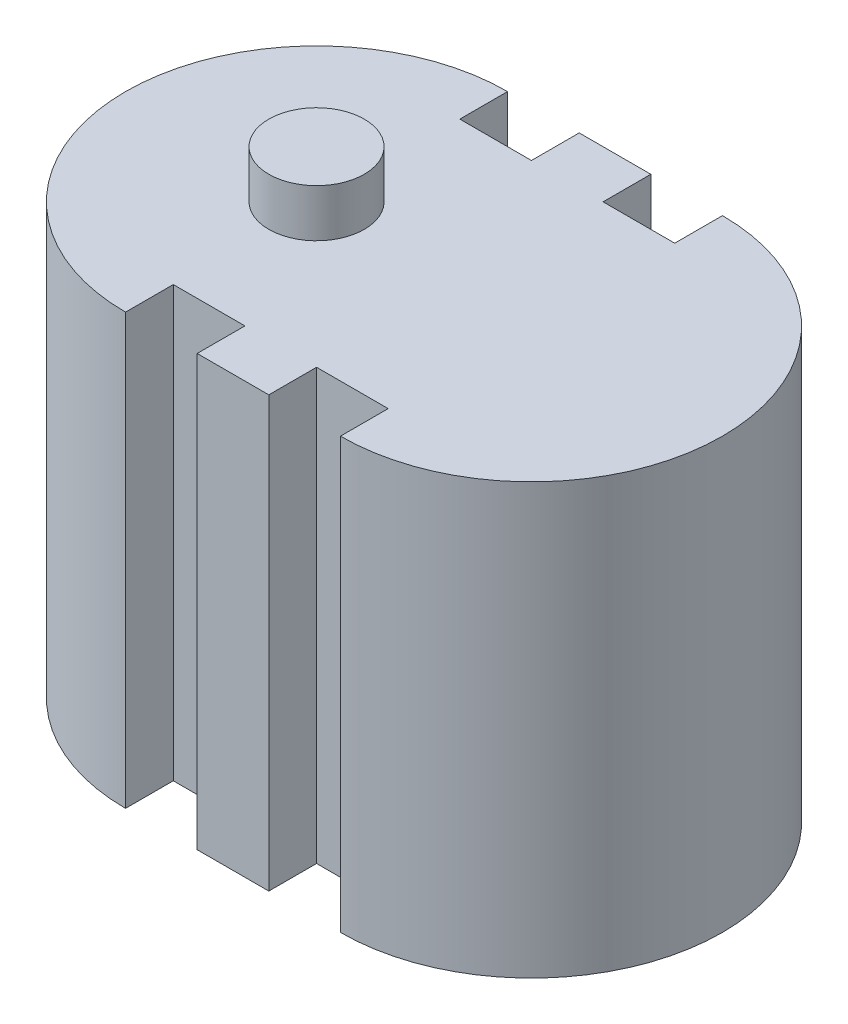
ISO-10303-21;
HEADER;
FILE_DESCRIPTION(('STEP AP214'),'2;1');
FILE_NAME('part.step','',(''),(''),'','','');
FILE_SCHEMA(('AUTOMOTIVE_DESIGN { 1 0 10303 214 1 1 1 1 }'));
ENDSEC;
DATA;
#1=APPLICATION_CONTEXT('core data for automotive mechanical design processes');
#2=APPLICATION_PROTOCOL_DEFINITION('international standard','automotive_design',2000,#1);
#3=PRODUCT_CONTEXT('',#1,'mechanical');
#4=PRODUCT('Part','Part','',(#3));
#5=PRODUCT_RELATED_PRODUCT_CATEGORY('part','',(#4));
#6=PRODUCT_DEFINITION_FORMATION('','',#4);
#7=PRODUCT_DEFINITION_CONTEXT('part definition',#1,'design');
#8=PRODUCT_DEFINITION('design','',#6,#7);
#9=PRODUCT_DEFINITION_SHAPE('','',#8);
#10=(LENGTH_UNIT() NAMED_UNIT(*) SI_UNIT(.MILLI.,.METRE.));
#11=(NAMED_UNIT(*) PLANE_ANGLE_UNIT() SI_UNIT($,.RADIAN.));
#12=(NAMED_UNIT(*) SI_UNIT($,.STERADIAN.) SOLID_ANGLE_UNIT());
#13=UNCERTAINTY_MEASURE_WITH_UNIT(LENGTH_MEASURE(1.E-05),#10,'distance_accuracy_value','');
#14=(GEOMETRIC_REPRESENTATION_CONTEXT(3) GLOBAL_UNCERTAINTY_ASSIGNED_CONTEXT((#13)) GLOBAL_UNIT_ASSIGNED_CONTEXT((#10,
#11,#12)) REPRESENTATION_CONTEXT('',''));
#15=CARTESIAN_POINT('',(0.,0.,0.));
#16=DIRECTION('',(0.,0.,1.));
#17=DIRECTION('',(1.,0.,0.));
#18=AXIS2_PLACEMENT_3D('',#15,#16,#17);
#19=CARTESIAN_POINT('',(0.,90.,0.));
#20=DIRECTION('',(0.,1.,0.));
#21=DIRECTION('',(0.,0.,1.));
#22=AXIS2_PLACEMENT_3D('',#19,#20,#21);
#23=PLANE('',#22);
#24=DIRECTION('',(0.,0.,1.));
#25=VECTOR('',#24,1.);
#26=CARTESIAN_POINT('',(15.,90.,-40.));
#27=LINE('',#26,#25);
#28=CARTESIAN_POINT('',(15.,90.,-40.));
#29=VERTEX_POINT('',#28);
#30=CARTESIAN_POINT('',(15.,90.,-30.));
#31=VERTEX_POINT('',#30);
#32=EDGE_CURVE('E195',#29,#31,#27,.T.);
#33=ORIENTED_EDGE('',*,*,#32,.T.);
#34=DIRECTION('',(-1.,0.,0.));
#35=VECTOR('',#34,1.);
#36=CARTESIAN_POINT('',(0.,90.,-30.));
#37=LINE('',#36,#35);
#38=CARTESIAN_POINT('',(0.,90.,-30.));
#39=VERTEX_POINT('',#38);
#40=EDGE_CURVE('E156',#31,#39,#37,.T.);
#41=ORIENTED_EDGE('',*,*,#40,.T.);
#42=DIRECTION('',(0.,0.,-1.));
#43=VECTOR('',#42,1.);
#44=CARTESIAN_POINT('',(0.,90.,-40.));
#45=LINE('',#44,#43);
#46=CARTESIAN_POINT('',(0.,90.,-40.));
#47=VERTEX_POINT('',#46);
#48=EDGE_CURVE('E198',#39,#47,#45,.T.);
#49=ORIENTED_EDGE('',*,*,#48,.T.);
#50=CARTESIAN_POINT('',(0.,90.,0.));
#51=DIRECTION('',(0.,1.,0.));
#52=DIRECTION('',(0.,0.,1.));
#53=AXIS2_PLACEMENT_3D('',#50,#51,#52);
#54=CIRCLE('',#53,40.);
#55=CARTESIAN_POINT('',(0.,90.,40.));
#56=VERTEX_POINT('',#55);
#57=EDGE_CURVE('E200',#47,#56,#54,.T.);
#58=ORIENTED_EDGE('',*,*,#57,.T.);
#59=DIRECTION('',(0.,0.,-1.));
#60=VECTOR('',#59,1.);
#61=CARTESIAN_POINT('',(0.,90.,30.));
#62=LINE('',#61,#60);
#63=CARTESIAN_POINT('',(0.,90.,30.));
#64=VERTEX_POINT('',#63);
#65=EDGE_CURVE('E202',#56,#64,#62,.T.);
#66=ORIENTED_EDGE('',*,*,#65,.T.);
#67=DIRECTION('',(1.,0.,0.));
#68=VECTOR('',#67,1.);
#69=CARTESIAN_POINT('',(15.,90.,30.));
#70=LINE('',#69,#68);
#71=CARTESIAN_POINT('',(15.,90.,30.));
#72=VERTEX_POINT('',#71);
#73=EDGE_CURVE('E204',#64,#72,#70,.T.);
#74=ORIENTED_EDGE('',*,*,#73,.T.);
#75=DIRECTION('',(0.,0.,1.));
#76=VECTOR('',#75,1.);
#77=CARTESIAN_POINT('',(15.,90.,30.));
#78=LINE('',#77,#76);
#79=CARTESIAN_POINT('',(15.,90.,40.));
#80=VERTEX_POINT('',#79);
#81=EDGE_CURVE('E206',#72,#80,#78,.T.);
#82=ORIENTED_EDGE('',*,*,#81,.T.);
#83=DIRECTION('',(1.,0.,0.));
#84=VECTOR('',#83,1.);
#85=CARTESIAN_POINT('',(30.,90.,40.));
#86=LINE('',#85,#84);
#87=CARTESIAN_POINT('',(30.,90.,40.));
#88=VERTEX_POINT('',#87);
#89=EDGE_CURVE('E208',#80,#88,#86,.T.);
#90=ORIENTED_EDGE('',*,*,#89,.T.);
#91=DIRECTION('',(0.,0.,-1.));
#92=VECTOR('',#91,1.);
#93=CARTESIAN_POINT('',(30.,90.,30.));
#94=LINE('',#93,#92);
#95=CARTESIAN_POINT('',(30.,90.,30.));
#96=VERTEX_POINT('',#95);
#97=EDGE_CURVE('E210',#88,#96,#94,.T.);
#98=ORIENTED_EDGE('',*,*,#97,.T.);
#99=DIRECTION('',(1.,0.,0.));
#100=VECTOR('',#99,1.);
#101=CARTESIAN_POINT('',(45.,90.,30.));
#102=LINE('',#101,#100);
#103=CARTESIAN_POINT('',(45.,90.,30.));
#104=VERTEX_POINT('',#103);
#105=EDGE_CURVE('E212',#96,#104,#102,.T.);
#106=ORIENTED_EDGE('',*,*,#105,.T.);
#107=DIRECTION('',(0.,0.,1.));
#108=VECTOR('',#107,1.);
#109=CARTESIAN_POINT('',(45.,90.,30.));
#110=LINE('',#109,#108);
#111=CARTESIAN_POINT('',(45.,90.,40.));
#112=VERTEX_POINT('',#111);
#113=EDGE_CURVE('E214',#104,#112,#110,.T.);
#114=ORIENTED_EDGE('',*,*,#113,.T.);
#115=CARTESIAN_POINT('',(45.,90.,0.));
#116=DIRECTION('',(0.,1.,0.));
#117=DIRECTION('',(0.,0.,1.));
#118=AXIS2_PLACEMENT_3D('',#115,#116,#117);
#119=CIRCLE('',#118,40.);
#120=CARTESIAN_POINT('',(45.,90.,-40.));
#121=VERTEX_POINT('',#120);
#122=EDGE_CURVE('E216',#112,#121,#119,.T.);
#123=ORIENTED_EDGE('',*,*,#122,.T.);
#124=DIRECTION('',(0.,0.,1.));
#125=VECTOR('',#124,1.);
#126=CARTESIAN_POINT('',(45.,90.,-40.));
#127=LINE('',#126,#125);
#128=CARTESIAN_POINT('',(45.,90.,-30.));
#129=VERTEX_POINT('',#128);
#130=EDGE_CURVE('E218',#121,#129,#127,.T.);
#131=ORIENTED_EDGE('',*,*,#130,.T.);
#132=DIRECTION('',(-1.,0.,0.));
#133=VECTOR('',#132,1.);
#134=CARTESIAN_POINT('',(30.,90.,-30.));
#135=LINE('',#134,#133);
#136=CARTESIAN_POINT('',(30.,90.,-30.));
#137=VERTEX_POINT('',#136);
#138=EDGE_CURVE('E220',#129,#137,#135,.T.);
#139=ORIENTED_EDGE('',*,*,#138,.T.);
#140=DIRECTION('',(0.,0.,-1.));
#141=VECTOR('',#140,1.);
#142=CARTESIAN_POINT('',(30.,90.,-40.));
#143=LINE('',#142,#141);
#144=CARTESIAN_POINT('',(30.,90.,-40.));
#145=VERTEX_POINT('',#144);
#146=EDGE_CURVE('E50',#137,#145,#143,.T.);
#147=ORIENTED_EDGE('',*,*,#146,.T.);
#148=DIRECTION('',(-1.,0.,0.));
#149=VECTOR('',#148,1.);
#150=CARTESIAN_POINT('',(15.,90.,-40.));
#151=LINE('',#150,#149);
#152=EDGE_CURVE('E45',#145,#29,#151,.T.);
#153=ORIENTED_EDGE('',*,*,#152,.T.);
#154=EDGE_LOOP('',(#33,#41,#49,#58,#66,#74,#82,#90,#98,#106,#114,#123,#131,#139,#147,#153));
#155=FACE_BOUND('',#154,.T.);
#156=CARTESIAN_POINT('',(0.,90.,0.));
#157=DIRECTION('',(0.,1.,0.));
#158=DIRECTION('',(0.,0.,1.));
#159=AXIS2_PLACEMENT_3D('',#156,#157,#158);
#160=CIRCLE('',#159,10.);
#161=CARTESIAN_POINT('',(0.,90.,10.));
#162=VERTEX_POINT('',#161);
#163=EDGE_CURVE('E164',#162,#162,#160,.T.);
#164=ORIENTED_EDGE('',*,*,#163,.F.);
#165=EDGE_LOOP('',(#164));
#166=FACE_BOUND('',#165,.T.);
#167=ADVANCED_FACE('F30',(#155,#166),#23,.T.);
#168=CARTESIAN_POINT('',(15.,90.,-40.));
#169=DIRECTION('',(1.,0.,0.));
#170=DIRECTION('',(0.,0.,-1.));
#171=AXIS2_PLACEMENT_3D('',#168,#169,#170);
#172=PLANE('',#171);
#173=DIRECTION('',(0.,0.,1.));
#174=VECTOR('',#173,1.);
#175=CARTESIAN_POINT('',(15.,0.,-40.));
#176=LINE('',#175,#174);
#177=CARTESIAN_POINT('',(15.,0.,-40.));
#178=VERTEX_POINT('',#177);
#179=CARTESIAN_POINT('',(15.,0.,-30.));
#180=VERTEX_POINT('',#179);
#181=EDGE_CURVE('E147',#178,#180,#176,.T.);
#182=ORIENTED_EDGE('',*,*,#181,.T.);
#183=DIRECTION('',(0.,-1.,0.));
#184=VECTOR('',#183,1.);
#185=CARTESIAN_POINT('',(15.,90.,-30.));
#186=LINE('',#185,#184);
#187=EDGE_CURVE('E11',#31,#180,#186,.T.);
#188=ORIENTED_EDGE('',*,*,#187,.F.);
#189=ORIENTED_EDGE('',*,*,#32,.F.);
#190=DIRECTION('',(0.,-1.,0.));
#191=VECTOR('',#190,1.);
#192=CARTESIAN_POINT('',(15.,90.,-40.));
#193=LINE('',#192,#191);
#194=EDGE_CURVE('E160',#29,#178,#193,.T.);
#195=ORIENTED_EDGE('',*,*,#194,.T.);
#196=EDGE_LOOP('',(#182,#188,#189,#195));
#197=FACE_BOUND('',#196,.T.);
#198=ADVANCED_FACE('F32',(#197),#172,.F.);
#199=CARTESIAN_POINT('',(0.,90.,-30.));
#200=DIRECTION('',(0.,0.,1.));
#201=DIRECTION('',(1.,0.,0.));
#202=AXIS2_PLACEMENT_3D('',#199,#200,#201);
#203=PLANE('',#202);
#204=DIRECTION('',(-1.,0.,0.));
#205=VECTOR('',#204,1.);
#206=CARTESIAN_POINT('',(0.,0.,-30.));
#207=LINE('',#206,#205);
#208=CARTESIAN_POINT('',(0.,0.,-30.));
#209=VERTEX_POINT('',#208);
#210=EDGE_CURVE('E143',#180,#209,#207,.T.);
#211=ORIENTED_EDGE('',*,*,#210,.T.);
#212=DIRECTION('',(0.,-1.,0.));
#213=VECTOR('',#212,1.);
#214=CARTESIAN_POINT('',(0.,90.,-30.));
#215=LINE('',#214,#213);
#216=EDGE_CURVE('E38',#39,#209,#215,.T.);
#217=ORIENTED_EDGE('',*,*,#216,.F.);
#218=ORIENTED_EDGE('',*,*,#40,.F.);
#219=ORIENTED_EDGE('',*,*,#187,.T.);
#220=EDGE_LOOP('',(#211,#217,#218,#219));
#221=FACE_BOUND('',#220,.T.);
#222=ADVANCED_FACE('F155',(#221),#203,.F.);
#223=CARTESIAN_POINT('',(0.,90.,-40.));
#224=DIRECTION('',(-1.,0.,0.));
#225=DIRECTION('',(0.,0.,1.));
#226=AXIS2_PLACEMENT_3D('',#223,#224,#225);
#227=PLANE('',#226);
#228=DIRECTION('',(0.,0.,-1.));
#229=VECTOR('',#228,1.);
#230=CARTESIAN_POINT('',(0.,0.,-40.));
#231=LINE('',#230,#229);
#232=CARTESIAN_POINT('',(0.,0.,-40.));
#233=VERTEX_POINT('',#232);
#234=EDGE_CURVE('E149',#209,#233,#231,.T.);
#235=ORIENTED_EDGE('',*,*,#234,.T.);
#236=DIRECTION('',(0.,-1.,0.));
#237=VECTOR('',#236,1.);
#238=CARTESIAN_POINT('',(0.,90.,-40.));
#239=LINE('',#238,#237);
#240=EDGE_CURVE('E261',#47,#233,#239,.T.);
#241=ORIENTED_EDGE('',*,*,#240,.F.);
#242=ORIENTED_EDGE('',*,*,#48,.F.);
#243=ORIENTED_EDGE('',*,*,#216,.T.);
#244=EDGE_LOOP('',(#235,#241,#242,#243));
#245=FACE_BOUND('',#244,.T.);
#246=ADVANCED_FACE('F265',(#245),#227,.F.);
#247=CARTESIAN_POINT('',(0.,90.,0.));
#248=DIRECTION('',(0.,-1.,0.));
#249=DIRECTION('',(0.,0.,-1.));
#250=AXIS2_PLACEMENT_3D('',#247,#248,#249);
#251=CYLINDRICAL_SURFACE('',#250,40.);
#252=CARTESIAN_POINT('',(0.,0.,0.));
#253=DIRECTION('',(0.,1.,0.));
#254=DIRECTION('',(0.,0.,1.));
#255=AXIS2_PLACEMENT_3D('',#252,#253,#254);
#256=CIRCLE('',#255,40.);
#257=CARTESIAN_POINT('',(0.,0.,40.));
#258=VERTEX_POINT('',#257);
#259=EDGE_CURVE('E169',#233,#258,#256,.T.);
#260=ORIENTED_EDGE('',*,*,#259,.T.);
#261=DIRECTION('',(0.,-1.,0.));
#262=VECTOR('',#261,1.);
#263=CARTESIAN_POINT('',(0.,90.,40.));
#264=LINE('',#263,#262);
#265=EDGE_CURVE('E258',#56,#258,#264,.T.);
#266=ORIENTED_EDGE('',*,*,#265,.F.);
#267=ORIENTED_EDGE('',*,*,#57,.F.);
#268=ORIENTED_EDGE('',*,*,#240,.T.);
#269=EDGE_LOOP('',(#260,#266,#267,#268));
#270=FACE_BOUND('',#269,.T.);
#271=ADVANCED_FACE('F273',(#270),#251,.T.);
#272=CARTESIAN_POINT('',(0.,90.,30.));
#273=DIRECTION('',(-1.,0.,0.));
#274=DIRECTION('',(0.,0.,1.));
#275=AXIS2_PLACEMENT_3D('',#272,#273,#274);
#276=PLANE('',#275);
#277=DIRECTION('',(0.,0.,-1.));
#278=VECTOR('',#277,1.);
#279=CARTESIAN_POINT('',(0.,0.,30.));
#280=LINE('',#279,#278);
#281=CARTESIAN_POINT('',(0.,0.,30.));
#282=VERTEX_POINT('',#281);
#283=EDGE_CURVE('E171',#258,#282,#280,.T.);
#284=ORIENTED_EDGE('',*,*,#283,.T.);
#285=DIRECTION('',(0.,-1.,0.));
#286=VECTOR('',#285,1.);
#287=CARTESIAN_POINT('',(0.,90.,30.));
#288=LINE('',#287,#286);
#289=EDGE_CURVE('E255',#64,#282,#288,.T.);
#290=ORIENTED_EDGE('',*,*,#289,.F.);
#291=ORIENTED_EDGE('',*,*,#65,.F.);
#292=ORIENTED_EDGE('',*,*,#265,.T.);
#293=EDGE_LOOP('',(#284,#290,#291,#292));
#294=FACE_BOUND('',#293,.T.);
#295=ADVANCED_FACE('F276',(#294),#276,.F.);
#296=CARTESIAN_POINT('',(15.,90.,30.));
#297=DIRECTION('',(0.,0.,-1.));
#298=DIRECTION('',(-1.,0.,0.));
#299=AXIS2_PLACEMENT_3D('',#296,#297,#298);
#300=PLANE('',#299);
#301=DIRECTION('',(1.,0.,0.));
#302=VECTOR('',#301,1.);
#303=CARTESIAN_POINT('',(15.,0.,30.));
#304=LINE('',#303,#302);
#305=CARTESIAN_POINT('',(15.,0.,30.));
#306=VERTEX_POINT('',#305);
#307=EDGE_CURVE('E173',#282,#306,#304,.T.);
#308=ORIENTED_EDGE('',*,*,#307,.T.);
#309=DIRECTION('',(0.,-1.,0.));
#310=VECTOR('',#309,1.);
#311=CARTESIAN_POINT('',(15.,90.,30.));
#312=LINE('',#311,#310);
#313=EDGE_CURVE('E252',#72,#306,#312,.T.);
#314=ORIENTED_EDGE('',*,*,#313,.F.);
#315=ORIENTED_EDGE('',*,*,#73,.F.);
#316=ORIENTED_EDGE('',*,*,#289,.T.);
#317=EDGE_LOOP('',(#308,#314,#315,#316));
#318=FACE_BOUND('',#317,.T.);
#319=ADVANCED_FACE('F281',(#318),#300,.F.);
#320=CARTESIAN_POINT('',(15.,90.,30.));
#321=DIRECTION('',(1.,0.,0.));
#322=DIRECTION('',(0.,0.,-1.));
#323=AXIS2_PLACEMENT_3D('',#320,#321,#322);
#324=PLANE('',#323);
#325=DIRECTION('',(0.,0.,1.));
#326=VECTOR('',#325,1.);
#327=CARTESIAN_POINT('',(15.,0.,30.));
#328=LINE('',#327,#326);
#329=CARTESIAN_POINT('',(15.,0.,40.));
#330=VERTEX_POINT('',#329);
#331=EDGE_CURVE('E175',#306,#330,#328,.T.);
#332=ORIENTED_EDGE('',*,*,#331,.T.);
#333=DIRECTION('',(0.,-1.,0.));
#334=VECTOR('',#333,1.);
#335=CARTESIAN_POINT('',(15.,90.,40.));
#336=LINE('',#335,#334);
#337=EDGE_CURVE('E249',#80,#330,#336,.T.);
#338=ORIENTED_EDGE('',*,*,#337,.F.);
#339=ORIENTED_EDGE('',*,*,#81,.F.);
#340=ORIENTED_EDGE('',*,*,#313,.T.);
#341=EDGE_LOOP('',(#332,#338,#339,#340));
#342=FACE_BOUND('',#341,.T.);
#343=ADVANCED_FACE('F287',(#342),#324,.F.);
#344=CARTESIAN_POINT('',(30.,90.,40.));
#345=DIRECTION('',(0.,0.,-1.));
#346=DIRECTION('',(-1.,0.,0.));
#347=AXIS2_PLACEMENT_3D('',#344,#345,#346);
#348=PLANE('',#347);
#349=DIRECTION('',(1.,0.,0.));
#350=VECTOR('',#349,1.);
#351=CARTESIAN_POINT('',(30.,0.,40.));
#352=LINE('',#351,#350);
#353=CARTESIAN_POINT('',(30.,0.,40.));
#354=VERTEX_POINT('',#353);
#355=EDGE_CURVE('E177',#330,#354,#352,.T.);
#356=ORIENTED_EDGE('',*,*,#355,.T.);
#357=DIRECTION('',(0.,-1.,0.));
#358=VECTOR('',#357,1.);
#359=CARTESIAN_POINT('',(30.,90.,40.));
#360=LINE('',#359,#358);
#361=EDGE_CURVE('E246',#88,#354,#360,.T.);
#362=ORIENTED_EDGE('',*,*,#361,.F.);
#363=ORIENTED_EDGE('',*,*,#89,.F.);
#364=ORIENTED_EDGE('',*,*,#337,.T.);
#365=EDGE_LOOP('',(#356,#362,#363,#364));
#366=FACE_BOUND('',#365,.T.);
#367=ADVANCED_FACE('F291',(#366),#348,.F.);
#368=CARTESIAN_POINT('',(30.,90.,30.));
#369=DIRECTION('',(-1.,0.,0.));
#370=DIRECTION('',(0.,0.,1.));
#371=AXIS2_PLACEMENT_3D('',#368,#369,#370);
#372=PLANE('',#371);
#373=DIRECTION('',(0.,0.,-1.));
#374=VECTOR('',#373,1.);
#375=CARTESIAN_POINT('',(30.,0.,30.));
#376=LINE('',#375,#374);
#377=CARTESIAN_POINT('',(30.,0.,30.));
#378=VERTEX_POINT('',#377);
#379=EDGE_CURVE('E179',#354,#378,#376,.T.);
#380=ORIENTED_EDGE('',*,*,#379,.T.);
#381=DIRECTION('',(0.,-1.,0.));
#382=VECTOR('',#381,1.);
#383=CARTESIAN_POINT('',(30.,90.,30.));
#384=LINE('',#383,#382);
#385=EDGE_CURVE('E243',#96,#378,#384,.T.);
#386=ORIENTED_EDGE('',*,*,#385,.F.);
#387=ORIENTED_EDGE('',*,*,#97,.F.);
#388=ORIENTED_EDGE('',*,*,#361,.T.);
#389=EDGE_LOOP('',(#380,#386,#387,#388));
#390=FACE_BOUND('',#389,.T.);
#391=ADVANCED_FACE('F296',(#390),#372,.F.);
#392=CARTESIAN_POINT('',(45.,90.,30.));
#393=DIRECTION('',(0.,0.,-1.));
#394=DIRECTION('',(-1.,0.,0.));
#395=AXIS2_PLACEMENT_3D('',#392,#393,#394);
#396=PLANE('',#395);
#397=DIRECTION('',(1.,0.,0.));
#398=VECTOR('',#397,1.);
#399=CARTESIAN_POINT('',(45.,0.,30.));
#400=LINE('',#399,#398);
#401=CARTESIAN_POINT('',(45.,0.,30.));
#402=VERTEX_POINT('',#401);
#403=EDGE_CURVE('E181',#378,#402,#400,.T.);
#404=ORIENTED_EDGE('',*,*,#403,.T.);
#405=DIRECTION('',(0.,-1.,0.));
#406=VECTOR('',#405,1.);
#407=CARTESIAN_POINT('',(45.,90.,30.));
#408=LINE('',#407,#406);
#409=EDGE_CURVE('E240',#104,#402,#408,.T.);
#410=ORIENTED_EDGE('',*,*,#409,.F.);
#411=ORIENTED_EDGE('',*,*,#105,.F.);
#412=ORIENTED_EDGE('',*,*,#385,.T.);
#413=EDGE_LOOP('',(#404,#410,#411,#412));
#414=FACE_BOUND('',#413,.T.);
#415=ADVANCED_FACE('F302',(#414),#396,.F.);
#416=CARTESIAN_POINT('',(45.,90.,30.));
#417=DIRECTION('',(1.,0.,0.));
#418=DIRECTION('',(0.,0.,-1.));
#419=AXIS2_PLACEMENT_3D('',#416,#417,#418);
#420=PLANE('',#419);
#421=DIRECTION('',(0.,0.,1.));
#422=VECTOR('',#421,1.);
#423=CARTESIAN_POINT('',(45.,0.,30.));
#424=LINE('',#423,#422);
#425=CARTESIAN_POINT('',(45.,0.,40.));
#426=VERTEX_POINT('',#425);
#427=EDGE_CURVE('E183',#402,#426,#424,.T.);
#428=ORIENTED_EDGE('',*,*,#427,.T.);
#429=DIRECTION('',(0.,-1.,0.));
#430=VECTOR('',#429,1.);
#431=CARTESIAN_POINT('',(45.,90.,40.));
#432=LINE('',#431,#430);
#433=EDGE_CURVE('E237',#112,#426,#432,.T.);
#434=ORIENTED_EDGE('',*,*,#433,.F.);
#435=ORIENTED_EDGE('',*,*,#113,.F.);
#436=ORIENTED_EDGE('',*,*,#409,.T.);
#437=EDGE_LOOP('',(#428,#434,#435,#436));
#438=FACE_BOUND('',#437,.T.);
#439=ADVANCED_FACE('F306',(#438),#420,.F.);
#440=CARTESIAN_POINT('',(45.,90.,0.));
#441=DIRECTION('',(0.,-1.,0.));
#442=DIRECTION('',(0.,0.,-1.));
#443=AXIS2_PLACEMENT_3D('',#440,#441,#442);
#444=CYLINDRICAL_SURFACE('',#443,40.);
#445=CARTESIAN_POINT('',(45.,0.,0.));
#446=DIRECTION('',(0.,1.,0.));
#447=DIRECTION('',(0.,0.,1.));
#448=AXIS2_PLACEMENT_3D('',#445,#446,#447);
#449=CIRCLE('',#448,40.);
#450=CARTESIAN_POINT('',(45.,0.,-40.));
#451=VERTEX_POINT('',#450);
#452=EDGE_CURVE('E185',#426,#451,#449,.T.);
#453=ORIENTED_EDGE('',*,*,#452,.T.);
#454=DIRECTION('',(0.,-1.,0.));
#455=VECTOR('',#454,1.);
#456=CARTESIAN_POINT('',(45.,90.,-40.));
#457=LINE('',#456,#455);
#458=EDGE_CURVE('E234',#121,#451,#457,.T.);
#459=ORIENTED_EDGE('',*,*,#458,.F.);
#460=ORIENTED_EDGE('',*,*,#122,.F.);
#461=ORIENTED_EDGE('',*,*,#433,.T.);
#462=EDGE_LOOP('',(#453,#459,#460,#461));
#463=FACE_BOUND('',#462,.T.);
#464=ADVANCED_FACE('F311',(#463),#444,.T.);
#465=CARTESIAN_POINT('',(45.,90.,-40.));
#466=DIRECTION('',(1.,0.,0.));
#467=DIRECTION('',(0.,0.,-1.));
#468=AXIS2_PLACEMENT_3D('',#465,#466,#467);
#469=PLANE('',#468);
#470=DIRECTION('',(0.,0.,1.));
#471=VECTOR('',#470,1.);
#472=CARTESIAN_POINT('',(45.,0.,-40.));
#473=LINE('',#472,#471);
#474=CARTESIAN_POINT('',(45.,0.,-30.));
#475=VERTEX_POINT('',#474);
#476=EDGE_CURVE('E187',#451,#475,#473,.T.);
#477=ORIENTED_EDGE('',*,*,#476,.T.);
#478=DIRECTION('',(0.,-1.,0.));
#479=VECTOR('',#478,1.);
#480=CARTESIAN_POINT('',(45.,90.,-30.));
#481=LINE('',#480,#479);
#482=EDGE_CURVE('E231',#129,#475,#481,.T.);
#483=ORIENTED_EDGE('',*,*,#482,.F.);
#484=ORIENTED_EDGE('',*,*,#130,.F.);
#485=ORIENTED_EDGE('',*,*,#458,.T.);
#486=EDGE_LOOP('',(#477,#483,#484,#485));
#487=FACE_BOUND('',#486,.T.);
#488=ADVANCED_FACE('F317',(#487),#469,.F.);
#489=CARTESIAN_POINT('',(30.,90.,-30.));
#490=DIRECTION('',(0.,0.,1.));
#491=DIRECTION('',(1.,0.,0.));
#492=AXIS2_PLACEMENT_3D('',#489,#490,#491);
#493=PLANE('',#492);
#494=DIRECTION('',(-1.,0.,0.));
#495=VECTOR('',#494,1.);
#496=CARTESIAN_POINT('',(30.,0.,-30.));
#497=LINE('',#496,#495);
#498=CARTESIAN_POINT('',(30.,0.,-30.));
#499=VERTEX_POINT('',#498);
#500=EDGE_CURVE('E189',#475,#499,#497,.T.);
#501=ORIENTED_EDGE('',*,*,#500,.T.);
#502=DIRECTION('',(0.,-1.,0.));
#503=VECTOR('',#502,1.);
#504=CARTESIAN_POINT('',(30.,90.,-30.));
#505=LINE('',#504,#503);
#506=EDGE_CURVE('E228',#137,#499,#505,.T.);
#507=ORIENTED_EDGE('',*,*,#506,.F.);
#508=ORIENTED_EDGE('',*,*,#138,.F.);
#509=ORIENTED_EDGE('',*,*,#482,.T.);
#510=EDGE_LOOP('',(#501,#507,#508,#509));
#511=FACE_BOUND('',#510,.T.);
#512=ADVANCED_FACE('F321',(#511),#493,.F.);
#513=CARTESIAN_POINT('',(30.,90.,-40.));
#514=DIRECTION('',(-1.,0.,0.));
#515=DIRECTION('',(0.,0.,1.));
#516=AXIS2_PLACEMENT_3D('',#513,#514,#515);
#517=PLANE('',#516);
#518=DIRECTION('',(0.,0.,-1.));
#519=VECTOR('',#518,1.);
#520=CARTESIAN_POINT('',(30.,0.,-40.));
#521=LINE('',#520,#519);
#522=CARTESIAN_POINT('',(30.,0.,-40.));
#523=VERTEX_POINT('',#522);
#524=EDGE_CURVE('E191',#499,#523,#521,.T.);
#525=ORIENTED_EDGE('',*,*,#524,.T.);
#526=DIRECTION('',(0.,-1.,0.));
#527=VECTOR('',#526,1.);
#528=CARTESIAN_POINT('',(30.,90.,-40.));
#529=LINE('',#528,#527);
#530=EDGE_CURVE('E225',#145,#523,#529,.T.);
#531=ORIENTED_EDGE('',*,*,#530,.F.);
#532=ORIENTED_EDGE('',*,*,#146,.F.);
#533=ORIENTED_EDGE('',*,*,#506,.T.);
#534=EDGE_LOOP('',(#525,#531,#532,#533));
#535=FACE_BOUND('',#534,.T.);
#536=ADVANCED_FACE('F324',(#535),#517,.F.);
#537=CARTESIAN_POINT('',(15.,90.,-40.));
#538=DIRECTION('',(0.,0.,1.));
#539=DIRECTION('',(1.,0.,0.));
#540=AXIS2_PLACEMENT_3D('',#537,#538,#539);
#541=PLANE('',#540);
#542=DIRECTION('',(-1.,0.,0.));
#543=VECTOR('',#542,1.);
#544=CARTESIAN_POINT('',(15.,0.,-40.));
#545=LINE('',#544,#543);
#546=EDGE_CURVE('E193',#523,#178,#545,.T.);
#547=ORIENTED_EDGE('',*,*,#546,.T.);
#548=ORIENTED_EDGE('',*,*,#194,.F.);
#549=ORIENTED_EDGE('',*,*,#152,.F.);
#550=ORIENTED_EDGE('',*,*,#530,.T.);
#551=EDGE_LOOP('',(#547,#548,#549,#550));
#552=FACE_BOUND('',#551,.T.);
#553=ADVANCED_FACE('F326',(#552),#541,.F.);
#554=CARTESIAN_POINT('',(0.,0.,0.));
#555=DIRECTION('',(0.,1.,0.));
#556=DIRECTION('',(0.,0.,1.));
#557=AXIS2_PLACEMENT_3D('',#554,#555,#556);
#558=PLANE('',#557);
#559=ORIENTED_EDGE('',*,*,#181,.F.);
#560=ORIENTED_EDGE('',*,*,#546,.F.);
#561=ORIENTED_EDGE('',*,*,#524,.F.);
#562=ORIENTED_EDGE('',*,*,#500,.F.);
#563=ORIENTED_EDGE('',*,*,#476,.F.);
#564=ORIENTED_EDGE('',*,*,#452,.F.);
#565=ORIENTED_EDGE('',*,*,#427,.F.);
#566=ORIENTED_EDGE('',*,*,#403,.F.);
#567=ORIENTED_EDGE('',*,*,#379,.F.);
#568=ORIENTED_EDGE('',*,*,#355,.F.);
#569=ORIENTED_EDGE('',*,*,#331,.F.);
#570=ORIENTED_EDGE('',*,*,#307,.F.);
#571=ORIENTED_EDGE('',*,*,#283,.F.);
#572=ORIENTED_EDGE('',*,*,#259,.F.);
#573=ORIENTED_EDGE('',*,*,#234,.F.);
#574=ORIENTED_EDGE('',*,*,#210,.F.);
#575=EDGE_LOOP('',(#559,#560,#561,#562,#563,#564,#565,#566,#567,#568,#569,#570,#571,#572,#573,#574));
#576=FACE_BOUND('',#575,.T.);
#577=ADVANCED_FACE('F144',(#576),#558,.F.);
#578=CARTESIAN_POINT('',(0.,100.,0.));
#579=DIRECTION('',(0.,-1.,0.));
#580=DIRECTION('',(0.,0.,-1.));
#581=AXIS2_PLACEMENT_3D('',#578,#579,#580);
#582=CYLINDRICAL_SURFACE('',#581,10.);
#583=CARTESIAN_POINT('',(0.,100.,0.));
#584=DIRECTION('',(0.,1.,0.));
#585=DIRECTION('',(0.,0.,1.));
#586=AXIS2_PLACEMENT_3D('',#583,#584,#585);
#587=CIRCLE('',#586,10.);
#588=CARTESIAN_POINT('',(0.,100.,10.));
#589=VERTEX_POINT('',#588);
#590=EDGE_CURVE('E161',#589,#589,#587,.T.);
#591=ORIENTED_EDGE('',*,*,#590,.F.);
#592=EDGE_LOOP('',(#591));
#593=FACE_BOUND('',#592,.T.);
#594=ORIENTED_EDGE('',*,*,#163,.T.);
#595=EDGE_LOOP('',(#594));
#596=FACE_BOUND('',#595,.T.);
#597=ADVANCED_FACE('F333',(#593,#596),#582,.T.);
#598=CARTESIAN_POINT('',(0.,100.,0.));
#599=DIRECTION('',(0.,1.,0.));
#600=DIRECTION('',(0.,0.,1.));
#601=AXIS2_PLACEMENT_3D('',#598,#599,#600);
#602=PLANE('',#601);
#603=ORIENTED_EDGE('',*,*,#590,.T.);
#604=EDGE_LOOP('',(#603));
#605=FACE_BOUND('',#604,.T.);
#606=ADVANCED_FACE('F344',(#605),#602,.T.);
#607=CLOSED_SHELL('',(#167,#198,#222,#246,#271,#295,#319,#343,#367,#391,#415,#439,#464,#488,
#512,#536,#553,#577,#597,#606));
#608=MANIFOLD_SOLID_BREP('B2',#607);
#609=ADVANCED_BREP_SHAPE_REPRESENTATION('',(#18,#608),#14);
#610=SHAPE_DEFINITION_REPRESENTATION(#9,#609);
ENDSEC;
END-ISO-10303-21;
